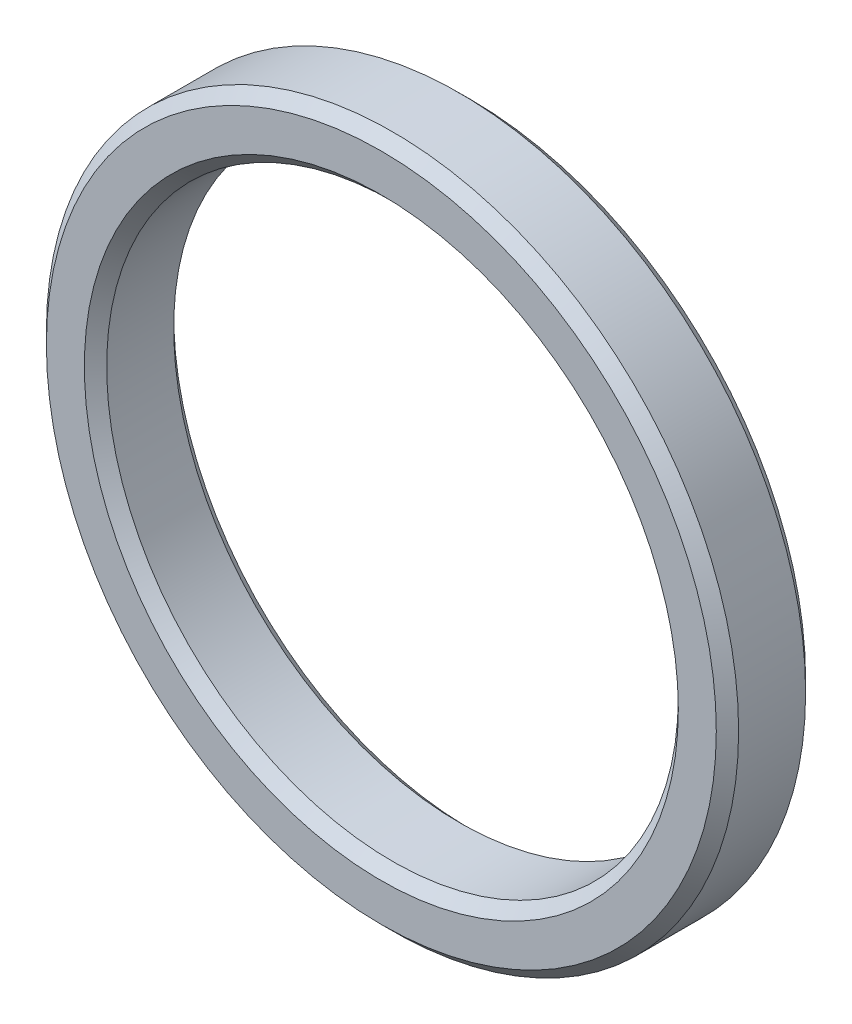
ISO-10303-21;
HEADER;
FILE_DESCRIPTION(('STEP AP214'),'2;1');
FILE_NAME('part.step','',(''),(''),'','','');
FILE_SCHEMA(('AUTOMOTIVE_DESIGN { 1 0 10303 214 1 1 1 1 }'));
ENDSEC;
DATA;
#1=APPLICATION_CONTEXT('core data for automotive mechanical design processes');
#2=APPLICATION_PROTOCOL_DEFINITION('international standard','automotive_design',2000,#1);
#3=PRODUCT_CONTEXT('',#1,'mechanical');
#4=PRODUCT('Part','Part','',(#3));
#5=PRODUCT_RELATED_PRODUCT_CATEGORY('part','',(#4));
#6=PRODUCT_DEFINITION_FORMATION('','',#4);
#7=PRODUCT_DEFINITION_CONTEXT('part definition',#1,'design');
#8=PRODUCT_DEFINITION('design','',#6,#7);
#9=PRODUCT_DEFINITION_SHAPE('','',#8);
#10=(LENGTH_UNIT() NAMED_UNIT(*) SI_UNIT(.MILLI.,.METRE.));
#11=(NAMED_UNIT(*) PLANE_ANGLE_UNIT() SI_UNIT($,.RADIAN.));
#12=(NAMED_UNIT(*) SI_UNIT($,.STERADIAN.) SOLID_ANGLE_UNIT());
#13=UNCERTAINTY_MEASURE_WITH_UNIT(LENGTH_MEASURE(1.E-05),#10,'distance_accuracy_value','');
#14=(GEOMETRIC_REPRESENTATION_CONTEXT(3) GLOBAL_UNCERTAINTY_ASSIGNED_CONTEXT((#13)) GLOBAL_UNIT_ASSIGNED_CONTEXT((#10,
#11,#12)) REPRESENTATION_CONTEXT('',''));
#15=CARTESIAN_POINT('',(0.,0.,0.));
#16=DIRECTION('',(0.,0.,1.));
#17=DIRECTION('',(1.,0.,0.));
#18=AXIS2_PLACEMENT_3D('',#15,#16,#17);
#19=CARTESIAN_POINT('',(0.,0.,4.));
#20=DIRECTION('',(0.,0.,1.));
#21=DIRECTION('',(1.,0.,0.));
#22=AXIS2_PLACEMENT_3D('',#19,#20,#21);
#23=PLANE('',#22);
#24=CARTESIAN_POINT('',(0.,0.,4.));
#25=DIRECTION('',(0.,0.,1.));
#26=DIRECTION('',(1.,0.,0.));
#27=AXIS2_PLACEMENT_3D('',#24,#25,#26);
#28=CIRCLE('',#27,13.3);
#29=CARTESIAN_POINT('',(13.3,0.,4.));
#30=VERTEX_POINT('',#29);
#31=EDGE_CURVE('E10',#30,#30,#28,.F.);
#32=ORIENTED_EDGE('',*,*,#31,.T.);
#33=EDGE_LOOP('',(#32));
#34=FACE_BOUND('',#33,.T.);
#35=CARTESIAN_POINT('',(0.,0.,4.));
#36=DIRECTION('',(0.,0.,1.));
#37=DIRECTION('',(1.,0.,0.));
#38=AXIS2_PLACEMENT_3D('',#35,#36,#37);
#39=CIRCLE('',#38,15.);
#40=CARTESIAN_POINT('',(15.,0.,4.));
#41=VERTEX_POINT('',#40);
#42=EDGE_CURVE('E40',#41,#41,#39,.T.);
#43=ORIENTED_EDGE('',*,*,#42,.T.);
#44=EDGE_LOOP('',(#43));
#45=FACE_BOUND('',#44,.T.);
#46=ADVANCED_FACE('F33',(#34,#45),#23,.T.);
#47=CARTESIAN_POINT('',(0.,0.,0.));
#48=DIRECTION('',(0.,0.,1.));
#49=DIRECTION('',(1.,0.,0.));
#50=AXIS2_PLACEMENT_3D('',#47,#48,#49);
#51=PLANE('',#50);
#52=CARTESIAN_POINT('',(0.,0.,0.));
#53=DIRECTION('',(0.,0.,1.));
#54=DIRECTION('',(1.,0.,0.));
#55=AXIS2_PLACEMENT_3D('',#52,#53,#54);
#56=CIRCLE('',#55,13.3);
#57=CARTESIAN_POINT('',(13.3,0.,0.));
#58=VERTEX_POINT('',#57);
#59=EDGE_CURVE('E59',#58,#58,#56,.T.);
#60=ORIENTED_EDGE('',*,*,#59,.T.);
#61=EDGE_LOOP('',(#60));
#62=FACE_BOUND('',#61,.T.);
#63=CARTESIAN_POINT('',(0.,0.,0.));
#64=DIRECTION('',(0.,0.,1.));
#65=DIRECTION('',(1.,0.,0.));
#66=AXIS2_PLACEMENT_3D('',#63,#64,#65);
#67=CIRCLE('',#66,15.);
#68=CARTESIAN_POINT('',(15.,0.,0.));
#69=VERTEX_POINT('',#68);
#70=EDGE_CURVE('E62',#69,#69,#67,.F.);
#71=ORIENTED_EDGE('',*,*,#70,.T.);
#72=EDGE_LOOP('',(#71));
#73=FACE_BOUND('',#72,.T.);
#74=ADVANCED_FACE('F66',(#62,#73),#51,.F.);
#75=CARTESIAN_POINT('',(0.,0.,4.));
#76=DIRECTION('',(0.,0.,-1.));
#77=DIRECTION('',(-1.,0.,0.));
#78=AXIS2_PLACEMENT_3D('',#75,#76,#77);
#79=CYLINDRICAL_SURFACE('',#78,15.5);
#80=CARTESIAN_POINT('',(0.,0.,0.500000000000002));
#81=DIRECTION('',(0.,0.,1.));
#82=DIRECTION('',(1.,0.,0.));
#83=AXIS2_PLACEMENT_3D('',#80,#81,#82);
#84=CIRCLE('',#83,15.5);
#85=CARTESIAN_POINT('',(15.5,0.,0.500000000000002));
#86=VERTEX_POINT('',#85);
#87=EDGE_CURVE('E44',#86,#86,#84,.T.);
#88=ORIENTED_EDGE('',*,*,#87,.T.);
#89=EDGE_LOOP('',(#88));
#90=FACE_BOUND('',#89,.T.);
#91=CARTESIAN_POINT('',(0.,0.,3.50000000000001));
#92=DIRECTION('',(0.,0.,1.));
#93=DIRECTION('',(1.,0.,0.));
#94=AXIS2_PLACEMENT_3D('',#91,#92,#93);
#95=CIRCLE('',#94,15.5);
#96=CARTESIAN_POINT('',(15.5,0.,3.50000000000001));
#97=VERTEX_POINT('',#96);
#98=EDGE_CURVE('E48',#97,#97,#95,.F.);
#99=ORIENTED_EDGE('',*,*,#98,.T.);
#100=EDGE_LOOP('',(#99));
#101=FACE_BOUND('',#100,.T.);
#102=ADVANCED_FACE('F76',(#90,#101),#79,.T.);
#103=CARTESIAN_POINT('',(0.,0.,4.));
#104=DIRECTION('',(0.,0.,-1.));
#105=DIRECTION('',(-1.,0.,0.));
#106=AXIS2_PLACEMENT_3D('',#103,#104,#105);
#107=CYLINDRICAL_SURFACE('',#106,12.8);
#108=CARTESIAN_POINT('',(0.,0.,0.499999999999999));
#109=DIRECTION('',(0.,0.,1.));
#110=DIRECTION('',(1.,0.,0.));
#111=AXIS2_PLACEMENT_3D('',#108,#109,#110);
#112=CIRCLE('',#111,12.8);
#113=CARTESIAN_POINT('',(12.8,0.,0.499999999999999));
#114=VERTEX_POINT('',#113);
#115=EDGE_CURVE('E53',#114,#114,#112,.F.);
#116=ORIENTED_EDGE('',*,*,#115,.T.);
#117=EDGE_LOOP('',(#116));
#118=FACE_BOUND('',#117,.T.);
#119=CARTESIAN_POINT('',(0.,0.,3.5));
#120=DIRECTION('',(0.,0.,1.));
#121=DIRECTION('',(1.,0.,0.));
#122=AXIS2_PLACEMENT_3D('',#119,#120,#121);
#123=CIRCLE('',#122,12.8);
#124=CARTESIAN_POINT('',(12.8,0.,3.5));
#125=VERTEX_POINT('',#124);
#126=EDGE_CURVE('E56',#125,#125,#123,.T.);
#127=ORIENTED_EDGE('',*,*,#126,.T.);
#128=EDGE_LOOP('',(#127));
#129=FACE_BOUND('',#128,.T.);
#130=ADVANCED_FACE('F79',(#118,#129),#107,.F.);
#131=CARTESIAN_POINT('',(0.,0.,0.));
#132=DIRECTION('',(0.,0.,-1.));
#133=DIRECTION('',(-1.,0.,0.));
#134=AXIS2_PLACEMENT_3D('',#131,#132,#133);
#135=CONICAL_SURFACE('',#134,13.3,0.785398163397452);
#136=ORIENTED_EDGE('',*,*,#115,.F.);
#137=EDGE_LOOP('',(#136));
#138=FACE_BOUND('',#137,.T.);
#139=ORIENTED_EDGE('',*,*,#59,.F.);
#140=EDGE_LOOP('',(#139));
#141=FACE_BOUND('',#140,.T.);
#142=ADVANCED_FACE('F72',(#138,#141),#135,.F.);
#143=CARTESIAN_POINT('',(0.,0.,0.500000000000002));
#144=DIRECTION('',(0.,0.,1.));
#145=DIRECTION('',(1.,0.,0.));
#146=AXIS2_PLACEMENT_3D('',#143,#144,#145);
#147=CONICAL_SURFACE('',#146,15.5,0.78539816339745);
#148=ORIENTED_EDGE('',*,*,#70,.F.);
#149=EDGE_LOOP('',(#148));
#150=FACE_BOUND('',#149,.T.);
#151=ORIENTED_EDGE('',*,*,#87,.F.);
#152=EDGE_LOOP('',(#151));
#153=FACE_BOUND('',#152,.T.);
#154=ADVANCED_FACE('F68',(#150,#153),#147,.T.);
#155=CARTESIAN_POINT('',(0.,0.,3.5));
#156=DIRECTION('',(0.,0.,1.));
#157=DIRECTION('',(1.,0.,0.));
#158=AXIS2_PLACEMENT_3D('',#155,#156,#157);
#159=CONICAL_SURFACE('',#158,12.8,0.78539816339745);
#160=ORIENTED_EDGE('',*,*,#31,.F.);
#161=EDGE_LOOP('',(#160));
#162=FACE_BOUND('',#161,.T.);
#163=ORIENTED_EDGE('',*,*,#126,.F.);
#164=EDGE_LOOP('',(#163));
#165=FACE_BOUND('',#164,.T.);
#166=ADVANCED_FACE('F71',(#162,#165),#159,.F.);
#167=CARTESIAN_POINT('',(0.,0.,4.));
#168=DIRECTION('',(0.,0.,-1.));
#169=DIRECTION('',(-1.,0.,0.));
#170=AXIS2_PLACEMENT_3D('',#167,#168,#169);
#171=CONICAL_SURFACE('',#170,15.,0.78539816339745);
#172=ORIENTED_EDGE('',*,*,#98,.F.);
#173=EDGE_LOOP('',(#172));
#174=FACE_BOUND('',#173,.T.);
#175=ORIENTED_EDGE('',*,*,#42,.F.);
#176=EDGE_LOOP('',(#175));
#177=FACE_BOUND('',#176,.T.);
#178=ADVANCED_FACE('F35',(#174,#177),#171,.T.);
#179=CLOSED_SHELL('',(#46,#74,#102,#130,#142,#154,#166,#178));
#180=MANIFOLD_SOLID_BREP('B2',#179);
#181=ADVANCED_BREP_SHAPE_REPRESENTATION('',(#18,#180),#14);
#182=SHAPE_DEFINITION_REPRESENTATION(#9,#181);
ENDSEC;
END-ISO-10303-21;
